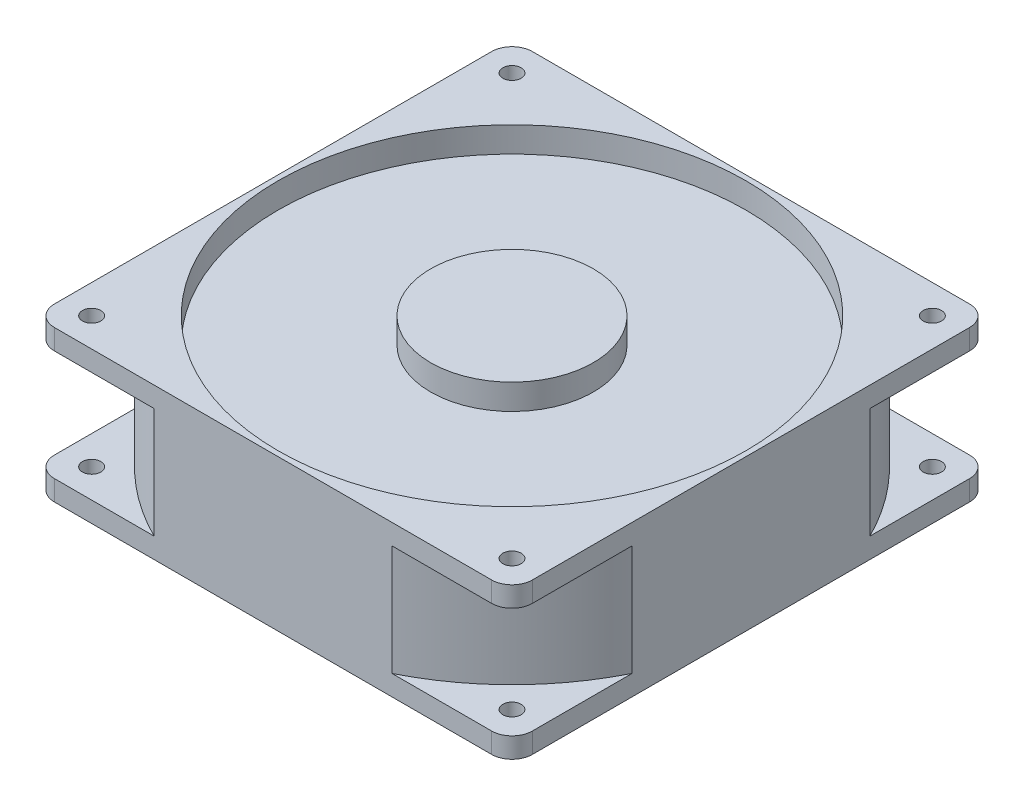
ISO-10303-21;
HEADER;
FILE_DESCRIPTION(('STEP AP214'),'2;1');
FILE_NAME('part.step','',(''),(''),'','','');
FILE_SCHEMA(('AUTOMOTIVE_DESIGN { 1 0 10303 214 1 1 1 1 }'));
ENDSEC;
DATA;
#1=APPLICATION_CONTEXT('core data for automotive mechanical design processes');
#2=APPLICATION_PROTOCOL_DEFINITION('international standard','automotive_design',2000,#1);
#3=PRODUCT_CONTEXT('',#1,'mechanical');
#4=PRODUCT('Part','Part','',(#3));
#5=PRODUCT_RELATED_PRODUCT_CATEGORY('part','',(#4));
#6=PRODUCT_DEFINITION_FORMATION('','',#4);
#7=PRODUCT_DEFINITION_CONTEXT('part definition',#1,'design');
#8=PRODUCT_DEFINITION('design','',#6,#7);
#9=PRODUCT_DEFINITION_SHAPE('','',#8);
#10=(LENGTH_UNIT() NAMED_UNIT(*) SI_UNIT(.MILLI.,.METRE.));
#11=(NAMED_UNIT(*) PLANE_ANGLE_UNIT() SI_UNIT($,.RADIAN.));
#12=(NAMED_UNIT(*) SI_UNIT($,.STERADIAN.) SOLID_ANGLE_UNIT());
#13=UNCERTAINTY_MEASURE_WITH_UNIT(LENGTH_MEASURE(1.E-05),#10,'distance_accuracy_value','');
#14=(GEOMETRIC_REPRESENTATION_CONTEXT(3) GLOBAL_UNCERTAINTY_ASSIGNED_CONTEXT((#13)) GLOBAL_UNIT_ASSIGNED_CONTEXT((#10,
#11,#12)) REPRESENTATION_CONTEXT('',''));
#15=CARTESIAN_POINT('',(0.,0.,0.));
#16=DIRECTION('',(0.,0.,1.));
#17=DIRECTION('',(1.,0.,0.));
#18=AXIS2_PLACEMENT_3D('',#15,#16,#17);
#19=CARTESIAN_POINT('',(2.67817733585345,37.75,-111.051162790698));
#20=DIRECTION('',(-1.,0.,0.));
#21=DIRECTION('',(0.,0.,1.));
#22=AXIS2_PLACEMENT_3D('',#19,#20,#21);
#23=PLANE('',#22);
#24=DIRECTION('',(0.,0.,-1.));
#25=VECTOR('',#24,1.);
#26=CARTESIAN_POINT('',(2.67817733585345,5.075,-111.051162790698));
#27=LINE('',#26,#25);
#28=CARTESIAN_POINT('',(2.67817733585345,5.075,3.24883720930234));
#29=VERTEX_POINT('',#28);
#30=CARTESIAN_POINT('',(2.67817733585345,5.075,-21.6515763748621));
#31=VERTEX_POINT('',#30);
#32=EDGE_CURVE('E367',#29,#31,#27,.T.);
#33=ORIENTED_EDGE('',*,*,#32,.F.);
#34=DIRECTION('',(0.,-1.,0.));
#35=VECTOR('',#34,1.);
#36=CARTESIAN_POINT('',(2.67817733585345,37.75,3.24883720930234));
#37=LINE('',#36,#35);
#38=CARTESIAN_POINT('',(2.67817733585345,0.,3.24883720930234));
#39=VERTEX_POINT('',#38);
#40=EDGE_CURVE('E267',#29,#39,#37,.T.);
#41=ORIENTED_EDGE('',*,*,#40,.T.);
#42=DIRECTION('',(0.,0.,-1.));
#43=VECTOR('',#42,1.);
#44=CARTESIAN_POINT('',(2.67817733585345,0.,-111.051162790698));
#45=LINE('',#44,#43);
#46=CARTESIAN_POINT('',(2.67817733585345,0.,-105.971162790698));
#47=VERTEX_POINT('',#46);
#48=EDGE_CURVE('E282',#39,#47,#45,.T.);
#49=ORIENTED_EDGE('',*,*,#48,.T.);
#50=DIRECTION('',(0.,-1.,0.));
#51=VECTOR('',#50,1.);
#52=CARTESIAN_POINT('',(2.67817733585345,37.75,-105.971162790698));
#53=LINE('',#52,#51);
#54=CARTESIAN_POINT('',(2.67817733585346,5.075,-105.971162790698));
#55=VERTEX_POINT('',#54);
#56=EDGE_CURVE('E268',#47,#55,#53,.F.);
#57=ORIENTED_EDGE('',*,*,#56,.T.);
#58=CARTESIAN_POINT('',(2.67817733585345,5.075,-81.0707492065333));
#59=VERTEX_POINT('',#58);
#60=EDGE_CURVE('E377',#59,#55,#27,.T.);
#61=ORIENTED_EDGE('',*,*,#60,.F.);
#62=DIRECTION('',(0.,1.,0.));
#63=VECTOR('',#62,1.);
#64=CARTESIAN_POINT('',(2.67817733585345,5.075,-81.0707492065333));
#65=LINE('',#64,#63);
#66=CARTESIAN_POINT('',(2.67817733585345,32.675,-81.0707492065333));
#67=VERTEX_POINT('',#66);
#68=EDGE_CURVE('E345',#67,#59,#65,.F.);
#69=ORIENTED_EDGE('',*,*,#68,.F.);
#70=DIRECTION('',(0.,0.,-1.));
#71=VECTOR('',#70,1.);
#72=CARTESIAN_POINT('',(2.67817733585345,32.675,-111.051162790698));
#73=LINE('',#72,#71);
#74=CARTESIAN_POINT('',(2.67817733585346,32.675,-105.971162790698));
#75=VERTEX_POINT('',#74);
#76=EDGE_CURVE('E403',#67,#75,#73,.T.);
#77=ORIENTED_EDGE('',*,*,#76,.T.);
#78=CARTESIAN_POINT('',(2.67817733585345,37.75,-105.971162790698));
#79=VERTEX_POINT('',#78);
#80=EDGE_CURVE('E271',#75,#79,#53,.F.);
#81=ORIENTED_EDGE('',*,*,#80,.T.);
#82=DIRECTION('',(0.,0.,-1.));
#83=VECTOR('',#82,1.);
#84=CARTESIAN_POINT('',(2.67817733585345,37.75,-111.051162790698));
#85=LINE('',#84,#83);
#86=CARTESIAN_POINT('',(2.67817733585345,37.75,3.24883720930234));
#87=VERTEX_POINT('',#86);
#88=EDGE_CURVE('E275',#87,#79,#85,.T.);
#89=ORIENTED_EDGE('',*,*,#88,.F.);
#90=CARTESIAN_POINT('',(2.67817733585345,32.675,3.24883720930234));
#91=VERTEX_POINT('',#90);
#92=EDGE_CURVE('E264',#87,#91,#37,.T.);
#93=ORIENTED_EDGE('',*,*,#92,.T.);
#94=CARTESIAN_POINT('',(2.67817733585345,32.675,-21.6515763748621));
#95=VERTEX_POINT('',#94);
#96=EDGE_CURVE('E49',#91,#95,#73,.T.);
#97=ORIENTED_EDGE('',*,*,#96,.T.);
#98=DIRECTION('',(0.,1.,0.));
#99=VECTOR('',#98,1.);
#100=CARTESIAN_POINT('',(2.67817733585345,5.075,-21.6515763748621));
#101=LINE('',#100,#99);
#102=EDGE_CURVE('E209',#31,#95,#101,.T.);
#103=ORIENTED_EDGE('',*,*,#102,.F.);
#104=EDGE_LOOP('',(#33,#41,#49,#57,#61,#69,#77,#81,#89,#93,#97,#103));
#105=FACE_BOUND('',#104,.T.);
#106=ADVANCED_FACE('F34',(#105),#23,.F.);
#107=CARTESIAN_POINT('',(-116.701822664147,37.75,-111.051162790698));
#108=DIRECTION('',(0.,0.,1.));
#109=DIRECTION('',(1.,0.,0.));
#110=AXIS2_PLACEMENT_3D('',#107,#108,#109);
#111=PLANE('',#110);
#112=DIRECTION('',(-1.,0.,0.));
#113=VECTOR('',#112,1.);
#114=CARTESIAN_POINT('',(-116.701822664147,5.075,-111.051162790698));
#115=LINE('',#114,#113);
#116=CARTESIAN_POINT('',(-2.40182266414654,5.075,-111.051162790698));
#117=VERTEX_POINT('',#116);
#118=CARTESIAN_POINT('',(-27.302236248311,5.075,-111.051162790698));
#119=VERTEX_POINT('',#118);
#120=EDGE_CURVE('E379',#117,#119,#115,.T.);
#121=ORIENTED_EDGE('',*,*,#120,.F.);
#122=DIRECTION('',(0.,-1.,0.));
#123=VECTOR('',#122,1.);
#124=CARTESIAN_POINT('',(-2.40182266414654,37.75,-111.051162790698));
#125=LINE('',#124,#123);
#126=CARTESIAN_POINT('',(-2.40182266414654,0.,-111.051162790698));
#127=VERTEX_POINT('',#126);
#128=EDGE_CURVE('E228',#117,#127,#125,.T.);
#129=ORIENTED_EDGE('',*,*,#128,.T.);
#130=DIRECTION('',(-1.,0.,0.));
#131=VECTOR('',#130,1.);
#132=CARTESIAN_POINT('',(-116.701822664147,0.,-111.051162790698));
#133=LINE('',#132,#131);
#134=CARTESIAN_POINT('',(-111.621822664147,0.,-111.051162790698));
#135=VERTEX_POINT('',#134);
#136=EDGE_CURVE('E279',#127,#135,#133,.T.);
#137=ORIENTED_EDGE('',*,*,#136,.T.);
#138=DIRECTION('',(0.,-1.,0.));
#139=VECTOR('',#138,1.);
#140=CARTESIAN_POINT('',(-111.621822664147,37.75,-111.051162790698));
#141=LINE('',#140,#139);
#142=CARTESIAN_POINT('',(-111.621822664147,5.075,-111.051162790698));
#143=VERTEX_POINT('',#142);
#144=EDGE_CURVE('E229',#135,#143,#141,.F.);
#145=ORIENTED_EDGE('',*,*,#144,.T.);
#146=CARTESIAN_POINT('',(-86.7214090799821,5.075,-111.051162790698));
#147=VERTEX_POINT('',#146);
#148=EDGE_CURVE('E383',#147,#143,#115,.T.);
#149=ORIENTED_EDGE('',*,*,#148,.F.);
#150=DIRECTION('',(0.,1.,0.));
#151=VECTOR('',#150,1.);
#152=CARTESIAN_POINT('',(-86.7214090799821,5.075,-111.051162790698));
#153=LINE('',#152,#151);
#154=CARTESIAN_POINT('',(-86.7214090799821,32.675,-111.051162790698));
#155=VERTEX_POINT('',#154);
#156=EDGE_CURVE('E349',#155,#147,#153,.F.);
#157=ORIENTED_EDGE('',*,*,#156,.F.);
#158=DIRECTION('',(-1.,0.,0.));
#159=VECTOR('',#158,1.);
#160=CARTESIAN_POINT('',(-116.701822664147,32.675,-111.051162790698));
#161=LINE('',#160,#159);
#162=CARTESIAN_POINT('',(-111.621822664147,32.675,-111.051162790698));
#163=VERTEX_POINT('',#162);
#164=EDGE_CURVE('E409',#155,#163,#161,.T.);
#165=ORIENTED_EDGE('',*,*,#164,.T.);
#166=CARTESIAN_POINT('',(-111.621822664147,37.75,-111.051162790698));
#167=VERTEX_POINT('',#166);
#168=EDGE_CURVE('E232',#163,#167,#141,.F.);
#169=ORIENTED_EDGE('',*,*,#168,.T.);
#170=DIRECTION('',(-1.,0.,0.));
#171=VECTOR('',#170,1.);
#172=CARTESIAN_POINT('',(-116.701822664147,37.75,-111.051162790698));
#173=LINE('',#172,#171);
#174=CARTESIAN_POINT('',(-2.40182266414654,37.75,-111.051162790698));
#175=VERTEX_POINT('',#174);
#176=EDGE_CURVE('E292',#175,#167,#173,.T.);
#177=ORIENTED_EDGE('',*,*,#176,.F.);
#178=CARTESIAN_POINT('',(-2.40182266414654,32.675,-111.051162790698));
#179=VERTEX_POINT('',#178);
#180=EDGE_CURVE('E225',#175,#179,#125,.T.);
#181=ORIENTED_EDGE('',*,*,#180,.T.);
#182=CARTESIAN_POINT('',(-27.302236248311,32.675,-111.051162790698));
#183=VERTEX_POINT('',#182);
#184=EDGE_CURVE('E406',#179,#183,#161,.T.);
#185=ORIENTED_EDGE('',*,*,#184,.T.);
#186=DIRECTION('',(0.,1.,0.));
#187=VECTOR('',#186,1.);
#188=CARTESIAN_POINT('',(-27.302236248311,5.075,-111.051162790698));
#189=LINE('',#188,#187);
#190=EDGE_CURVE('E347',#119,#183,#189,.T.);
#191=ORIENTED_EDGE('',*,*,#190,.F.);
#192=EDGE_LOOP('',(#121,#129,#137,#145,#149,#157,#165,#169,#177,#181,#185,#191));
#193=FACE_BOUND('',#192,.T.);
#194=ADVANCED_FACE('F450',(#193),#111,.F.);
#195=CARTESIAN_POINT('',(-116.701822664147,37.75,-111.051162790698));
#196=DIRECTION('',(1.,0.,0.));
#197=DIRECTION('',(0.,0.,-1.));
#198=AXIS2_PLACEMENT_3D('',#195,#196,#197);
#199=PLANE('',#198);
#200=DIRECTION('',(0.,0.,1.));
#201=VECTOR('',#200,1.);
#202=CARTESIAN_POINT('',(-116.701822664147,5.075,-111.051162790698));
#203=LINE('',#202,#201);
#204=CARTESIAN_POINT('',(-116.701822664147,5.075,-105.971162790698));
#205=VERTEX_POINT('',#204);
#206=CARTESIAN_POINT('',(-116.701822664147,5.075,-81.0707492065333));
#207=VERTEX_POINT('',#206);
#208=EDGE_CURVE('E385',#205,#207,#203,.T.);
#209=ORIENTED_EDGE('',*,*,#208,.F.);
#210=DIRECTION('',(0.,-1.,0.));
#211=VECTOR('',#210,1.);
#212=CARTESIAN_POINT('',(-116.701822664147,37.75,-105.971162790698));
#213=LINE('',#212,#211);
#214=CARTESIAN_POINT('',(-116.701822664147,0.,-105.971162790698));
#215=VERTEX_POINT('',#214);
#216=EDGE_CURVE('E240',#205,#215,#213,.T.);
#217=ORIENTED_EDGE('',*,*,#216,.T.);
#218=DIRECTION('',(0.,0.,1.));
#219=VECTOR('',#218,1.);
#220=CARTESIAN_POINT('',(-116.701822664147,0.,-111.051162790698));
#221=LINE('',#220,#219);
#222=CARTESIAN_POINT('',(-116.701822664147,0.,3.24883720930234));
#223=VERTEX_POINT('',#222);
#224=EDGE_CURVE('E276',#215,#223,#221,.T.);
#225=ORIENTED_EDGE('',*,*,#224,.T.);
#226=DIRECTION('',(0.,-1.,0.));
#227=VECTOR('',#226,1.);
#228=CARTESIAN_POINT('',(-116.701822664147,37.75,3.24883720930234));
#229=LINE('',#228,#227);
#230=CARTESIAN_POINT('',(-116.701822664147,5.075,3.24883720930234));
#231=VERTEX_POINT('',#230);
#232=EDGE_CURVE('E233',#223,#231,#229,.F.);
#233=ORIENTED_EDGE('',*,*,#232,.T.);
#234=CARTESIAN_POINT('',(-116.701822664147,5.075,-21.6515763748621));
#235=VERTEX_POINT('',#234);
#236=EDGE_CURVE('E371',#235,#231,#203,.T.);
#237=ORIENTED_EDGE('',*,*,#236,.F.);
#238=DIRECTION('',(0.,1.,0.));
#239=VECTOR('',#238,1.);
#240=CARTESIAN_POINT('',(-116.701822664147,5.075,-21.6515763748621));
#241=LINE('',#240,#239);
#242=CARTESIAN_POINT('',(-116.701822664147,32.675,-21.6515763748621));
#243=VERTEX_POINT('',#242);
#244=EDGE_CURVE('E353',#243,#235,#241,.F.);
#245=ORIENTED_EDGE('',*,*,#244,.F.);
#246=DIRECTION('',(0.,0.,1.));
#247=VECTOR('',#246,1.);
#248=CARTESIAN_POINT('',(-116.701822664147,32.675,-111.051162790698));
#249=LINE('',#248,#247);
#250=CARTESIAN_POINT('',(-116.701822664147,32.675,3.24883720930234));
#251=VERTEX_POINT('',#250);
#252=EDGE_CURVE('E399',#243,#251,#249,.T.);
#253=ORIENTED_EDGE('',*,*,#252,.T.);
#254=CARTESIAN_POINT('',(-116.701822664147,37.75,3.24883720930234));
#255=VERTEX_POINT('',#254);
#256=EDGE_CURVE('E236',#251,#255,#229,.F.);
#257=ORIENTED_EDGE('',*,*,#256,.T.);
#258=DIRECTION('',(0.,0.,1.));
#259=VECTOR('',#258,1.);
#260=CARTESIAN_POINT('',(-116.701822664147,37.75,-111.051162790698));
#261=LINE('',#260,#259);
#262=CARTESIAN_POINT('',(-116.701822664147,37.75,-105.971162790698));
#263=VERTEX_POINT('',#262);
#264=EDGE_CURVE('E289',#263,#255,#261,.T.);
#265=ORIENTED_EDGE('',*,*,#264,.F.);
#266=CARTESIAN_POINT('',(-116.701822664147,32.675,-105.971162790698));
#267=VERTEX_POINT('',#266);
#268=EDGE_CURVE('E237',#263,#267,#213,.T.);
#269=ORIENTED_EDGE('',*,*,#268,.T.);
#270=CARTESIAN_POINT('',(-116.701822664147,32.675,-81.0707492065333));
#271=VERTEX_POINT('',#270);
#272=EDGE_CURVE('E412',#267,#271,#249,.T.);
#273=ORIENTED_EDGE('',*,*,#272,.T.);
#274=DIRECTION('',(0.,1.,0.));
#275=VECTOR('',#274,1.);
#276=CARTESIAN_POINT('',(-116.701822664147,5.075,-81.0707492065333));
#277=LINE('',#276,#275);
#278=EDGE_CURVE('E351',#207,#271,#277,.T.);
#279=ORIENTED_EDGE('',*,*,#278,.F.);
#280=EDGE_LOOP('',(#209,#217,#225,#233,#237,#245,#253,#257,#265,#269,#273,#279));
#281=FACE_BOUND('',#280,.T.);
#282=ADVANCED_FACE('F435',(#281),#199,.F.);
#283=CARTESIAN_POINT('',(-116.701822664147,37.75,8.32883720930234));
#284=DIRECTION('',(0.,0.,-1.));
#285=DIRECTION('',(-1.,0.,0.));
#286=AXIS2_PLACEMENT_3D('',#283,#284,#285);
#287=PLANE('',#286);
#288=DIRECTION('',(1.,0.,0.));
#289=VECTOR('',#288,1.);
#290=CARTESIAN_POINT('',(-116.701822664147,5.075,8.32883720930234));
#291=LINE('',#290,#289);
#292=CARTESIAN_POINT('',(-111.621822664147,5.075,8.32883720930234));
#293=VERTEX_POINT('',#292);
#294=CARTESIAN_POINT('',(-86.7214090799821,5.075,8.32883720930234));
#295=VERTEX_POINT('',#294);
#296=EDGE_CURVE('E372',#293,#295,#291,.T.);
#297=ORIENTED_EDGE('',*,*,#296,.F.);
#298=DIRECTION('',(0.,-1.,0.));
#299=VECTOR('',#298,1.);
#300=CARTESIAN_POINT('',(-111.621822664147,37.75,8.32883720930234));
#301=LINE('',#300,#299);
#302=CARTESIAN_POINT('',(-111.621822664147,0.,8.32883720930234));
#303=VERTEX_POINT('',#302);
#304=EDGE_CURVE('E255',#293,#303,#301,.T.);
#305=ORIENTED_EDGE('',*,*,#304,.T.);
#306=DIRECTION('',(1.,0.,0.));
#307=VECTOR('',#306,1.);
#308=CARTESIAN_POINT('',(-116.701822664147,0.,8.32883720930234));
#309=LINE('',#308,#307);
#310=CARTESIAN_POINT('',(-2.40182266414657,0.,8.32883720930234));
#311=VERTEX_POINT('',#310);
#312=EDGE_CURVE('E272',#303,#311,#309,.T.);
#313=ORIENTED_EDGE('',*,*,#312,.T.);
#314=DIRECTION('',(0.,-1.,0.));
#315=VECTOR('',#314,1.);
#316=CARTESIAN_POINT('',(-2.40182266414654,37.75,8.32883720930234));
#317=LINE('',#316,#315);
#318=CARTESIAN_POINT('',(-2.40182266414655,5.075,8.32883720930234));
#319=VERTEX_POINT('',#318);
#320=EDGE_CURVE('E249',#311,#319,#317,.F.);
#321=ORIENTED_EDGE('',*,*,#320,.T.);
#322=CARTESIAN_POINT('',(-27.302236248311,5.075,8.32883720930234));
#323=VERTEX_POINT('',#322);
#324=EDGE_CURVE('E218',#323,#319,#291,.T.);
#325=ORIENTED_EDGE('',*,*,#324,.F.);
#326=DIRECTION('',(0.,1.,0.));
#327=VECTOR('',#326,1.);
#328=CARTESIAN_POINT('',(-27.302236248311,5.075,8.32883720930234));
#329=LINE('',#328,#327);
#330=CARTESIAN_POINT('',(-27.302236248311,32.675,8.32883720930234));
#331=VERTEX_POINT('',#330);
#332=EDGE_CURVE('E42',#331,#323,#329,.F.);
#333=ORIENTED_EDGE('',*,*,#332,.F.);
#334=DIRECTION('',(1.,0.,0.));
#335=VECTOR('',#334,1.);
#336=CARTESIAN_POINT('',(-116.701822664147,32.675,8.32883720930234));
#337=LINE('',#336,#335);
#338=CARTESIAN_POINT('',(-2.40182266414655,32.675,8.32883720930234));
#339=VERTEX_POINT('',#338);
#340=EDGE_CURVE('E194',#331,#339,#337,.T.);
#341=ORIENTED_EDGE('',*,*,#340,.T.);
#342=CARTESIAN_POINT('',(-2.40182266414657,37.75,8.32883720930234));
#343=VERTEX_POINT('',#342);
#344=EDGE_CURVE('E251',#339,#343,#317,.F.);
#345=ORIENTED_EDGE('',*,*,#344,.T.);
#346=DIRECTION('',(1.,0.,0.));
#347=VECTOR('',#346,1.);
#348=CARTESIAN_POINT('',(-116.701822664147,37.75,8.32883720930234));
#349=LINE('',#348,#347);
#350=CARTESIAN_POINT('',(-111.621822664147,37.75,8.32883720930234));
#351=VERTEX_POINT('',#350);
#352=EDGE_CURVE('E286',#351,#343,#349,.T.);
#353=ORIENTED_EDGE('',*,*,#352,.F.);
#354=CARTESIAN_POINT('',(-111.621822664147,32.675,8.32883720930234));
#355=VERTEX_POINT('',#354);
#356=EDGE_CURVE('E252',#351,#355,#301,.T.);
#357=ORIENTED_EDGE('',*,*,#356,.T.);
#358=CARTESIAN_POINT('',(-86.7214090799821,32.675,8.32883720930234));
#359=VERTEX_POINT('',#358);
#360=EDGE_CURVE('E57',#355,#359,#337,.T.);
#361=ORIENTED_EDGE('',*,*,#360,.T.);
#362=DIRECTION('',(0.,1.,0.));
#363=VECTOR('',#362,1.);
#364=CARTESIAN_POINT('',(-86.7214090799821,5.075,8.32883720930234));
#365=LINE('',#364,#363);
#366=EDGE_CURVE('E11',#295,#359,#365,.T.);
#367=ORIENTED_EDGE('',*,*,#366,.F.);
#368=EDGE_LOOP('',(#297,#305,#313,#321,#325,#333,#341,#345,#353,#357,#361,#367));
#369=FACE_BOUND('',#368,.T.);
#370=ADVANCED_FACE('F216',(#369),#287,.F.);
#371=CARTESIAN_POINT('',(-109.511822664147,0.,-103.861162790698));
#372=DIRECTION('',(0.,1.,0.));
#373=DIRECTION('',(0.,0.,1.));
#374=AXIS2_PLACEMENT_3D('',#371,#372,#373);
#375=CYLINDRICAL_SURFACE('',#374,2.28599999999999);
#376=CARTESIAN_POINT('',(-109.511822664147,0.,-103.861162790698));
#377=DIRECTION('',(0.,1.,0.));
#378=DIRECTION('',(0.,0.,1.));
#379=AXIS2_PLACEMENT_3D('',#376,#377,#378);
#380=CIRCLE('',#379,2.28599999999999);
#381=CARTESIAN_POINT('',(-109.511822664147,0.,-101.575162790698));
#382=VERTEX_POINT('',#381);
#383=EDGE_CURVE('E285',#382,#382,#380,.T.);
#384=ORIENTED_EDGE('',*,*,#383,.F.);
#385=EDGE_LOOP('',(#384));
#386=FACE_BOUND('',#385,.T.);
#387=CARTESIAN_POINT('',(-109.511822664147,5.075,-103.861162790698));
#388=DIRECTION('',(0.,1.,0.));
#389=DIRECTION('',(0.,0.,1.));
#390=AXIS2_PLACEMENT_3D('',#387,#388,#389);
#391=CIRCLE('',#390,2.28599999999999);
#392=CARTESIAN_POINT('',(-109.511822664147,5.075,-101.575162790698));
#393=VERTEX_POINT('',#392);
#394=EDGE_CURVE('E355',#393,#393,#391,.F.);
#395=ORIENTED_EDGE('',*,*,#394,.F.);
#396=EDGE_LOOP('',(#395));
#397=FACE_BOUND('',#396,.T.);
#398=ADVANCED_FACE('F533',(#386,#397),#375,.F.);
#399=CARTESIAN_POINT('',(-109.511822664147,0.,1.1388372093023));
#400=DIRECTION('',(0.,1.,0.));
#401=DIRECTION('',(0.,0.,1.));
#402=AXIS2_PLACEMENT_3D('',#399,#400,#401);
#403=CYLINDRICAL_SURFACE('',#402,2.28599999999999);
#404=CARTESIAN_POINT('',(-109.511822664147,0.,1.1388372093023));
#405=DIRECTION('',(0.,1.,0.));
#406=DIRECTION('',(0.,0.,1.));
#407=AXIS2_PLACEMENT_3D('',#404,#405,#406);
#408=CIRCLE('',#407,2.28599999999999);
#409=CARTESIAN_POINT('',(-109.511822664147,0.,3.4248372093023));
#410=VERTEX_POINT('',#409);
#411=EDGE_CURVE('E306',#410,#410,#408,.T.);
#412=ORIENTED_EDGE('',*,*,#411,.F.);
#413=EDGE_LOOP('',(#412));
#414=FACE_BOUND('',#413,.T.);
#415=CARTESIAN_POINT('',(-109.511822664147,5.075,1.1388372093023));
#416=DIRECTION('',(0.,1.,0.));
#417=DIRECTION('',(0.,0.,1.));
#418=AXIS2_PLACEMENT_3D('',#415,#416,#417);
#419=CIRCLE('',#418,2.28599999999999);
#420=CARTESIAN_POINT('',(-109.511822664147,5.075,3.4248372093023));
#421=VERTEX_POINT('',#420);
#422=EDGE_CURVE('E358',#421,#421,#419,.F.);
#423=ORIENTED_EDGE('',*,*,#422,.F.);
#424=EDGE_LOOP('',(#423));
#425=FACE_BOUND('',#424,.T.);
#426=ADVANCED_FACE('F550',(#414,#425),#403,.F.);
#427=CARTESIAN_POINT('',(-4.51182266414656,0.,1.1388372093023));
#428=DIRECTION('',(0.,1.,0.));
#429=DIRECTION('',(0.,0.,1.));
#430=AXIS2_PLACEMENT_3D('',#427,#428,#429);
#431=CYLINDRICAL_SURFACE('',#430,2.28600000000001);
#432=CARTESIAN_POINT('',(-4.51182266414656,0.,1.1388372093023));
#433=DIRECTION('',(0.,1.,0.));
#434=DIRECTION('',(0.,0.,1.));
#435=AXIS2_PLACEMENT_3D('',#432,#433,#434);
#436=CIRCLE('',#435,2.28600000000001);
#437=CARTESIAN_POINT('',(-4.51182266414656,0.,3.42483720930231));
#438=VERTEX_POINT('',#437);
#439=EDGE_CURVE('E313',#438,#438,#436,.T.);
#440=ORIENTED_EDGE('',*,*,#439,.F.);
#441=EDGE_LOOP('',(#440));
#442=FACE_BOUND('',#441,.T.);
#443=CARTESIAN_POINT('',(-4.51182266414656,5.075,1.1388372093023));
#444=DIRECTION('',(0.,1.,0.));
#445=DIRECTION('',(0.,0.,1.));
#446=AXIS2_PLACEMENT_3D('',#443,#444,#445);
#447=CIRCLE('',#446,2.28600000000001);
#448=CARTESIAN_POINT('',(-4.51182266414656,5.075,3.42483720930231));
#449=VERTEX_POINT('',#448);
#450=EDGE_CURVE('E361',#449,#449,#447,.F.);
#451=ORIENTED_EDGE('',*,*,#450,.F.);
#452=EDGE_LOOP('',(#451));
#453=FACE_BOUND('',#452,.T.);
#454=ADVANCED_FACE('F555',(#442,#453),#431,.F.);
#455=CARTESIAN_POINT('',(-4.51182266414654,0.,-103.861162790698));
#456=DIRECTION('',(0.,1.,0.));
#457=DIRECTION('',(0.,0.,1.));
#458=AXIS2_PLACEMENT_3D('',#455,#456,#457);
#459=CYLINDRICAL_SURFACE('',#458,2.28600000000001);
#460=CARTESIAN_POINT('',(-4.51182266414654,0.,-103.861162790698));
#461=DIRECTION('',(0.,1.,0.));
#462=DIRECTION('',(0.,0.,1.));
#463=AXIS2_PLACEMENT_3D('',#460,#461,#462);
#464=CIRCLE('',#463,2.28600000000001);
#465=CARTESIAN_POINT('',(-4.51182266414654,0.,-101.575162790698));
#466=VERTEX_POINT('',#465);
#467=EDGE_CURVE('E300',#466,#466,#464,.T.);
#468=ORIENTED_EDGE('',*,*,#467,.F.);
#469=EDGE_LOOP('',(#468));
#470=FACE_BOUND('',#469,.T.);
#471=CARTESIAN_POINT('',(-4.51182266414654,5.075,-103.861162790698));
#472=DIRECTION('',(0.,1.,0.));
#473=DIRECTION('',(0.,0.,1.));
#474=AXIS2_PLACEMENT_3D('',#471,#472,#473);
#475=CIRCLE('',#474,2.28600000000001);
#476=CARTESIAN_POINT('',(-4.51182266414654,5.075,-101.575162790698));
#477=VERTEX_POINT('',#476);
#478=EDGE_CURVE('E364',#477,#477,#475,.F.);
#479=ORIENTED_EDGE('',*,*,#478,.F.);
#480=EDGE_LOOP('',(#479));
#481=FACE_BOUND('',#480,.T.);
#482=ADVANCED_FACE('F522',(#470,#481),#459,.F.);
#483=CARTESIAN_POINT('',(-2.40182266414655,37.75,3.24883720930234));
#484=DIRECTION('',(0.,-1.,0.));
#485=DIRECTION('',(0.,0.,-1.));
#486=AXIS2_PLACEMENT_3D('',#483,#484,#485);
#487=CYLINDRICAL_SURFACE('',#486,5.08);
#488=ORIENTED_EDGE('',*,*,#40,.F.);
#489=CARTESIAN_POINT('',(-2.40182266414655,5.075,3.24883720930234));
#490=DIRECTION('',(0.,1.,0.));
#491=DIRECTION('',(0.,0.,1.));
#492=AXIS2_PLACEMENT_3D('',#489,#490,#491);
#493=CIRCLE('',#492,5.08);
#494=EDGE_CURVE('E368',#29,#319,#493,.F.);
#495=ORIENTED_EDGE('',*,*,#494,.T.);
#496=ORIENTED_EDGE('',*,*,#320,.F.);
#497=CARTESIAN_POINT('',(-2.40182266414655,0.,3.24883720930234));
#498=DIRECTION('',(0.,1.,0.));
#499=DIRECTION('',(0.,0.,1.));
#500=AXIS2_PLACEMENT_3D('',#497,#498,#499);
#501=CIRCLE('',#500,5.08);
#502=EDGE_CURVE('E256',#39,#311,#501,.F.);
#503=ORIENTED_EDGE('',*,*,#502,.F.);
#504=EDGE_LOOP('',(#488,#495,#496,#503));
#505=FACE_BOUND('',#504,.T.);
#506=ADVANCED_FACE('F499',(#505),#487,.T.);
#507=CARTESIAN_POINT('',(-111.621822664147,37.75,3.24883720930234));
#508=DIRECTION('',(0.,-1.,0.));
#509=DIRECTION('',(0.,0.,-1.));
#510=AXIS2_PLACEMENT_3D('',#507,#508,#509);
#511=CYLINDRICAL_SURFACE('',#510,5.08);
#512=ORIENTED_EDGE('',*,*,#304,.F.);
#513=CARTESIAN_POINT('',(-111.621822664147,5.075,3.24883720930234));
#514=DIRECTION('',(0.,1.,0.));
#515=DIRECTION('',(0.,0.,1.));
#516=AXIS2_PLACEMENT_3D('',#513,#514,#515);
#517=CIRCLE('',#516,5.08);
#518=EDGE_CURVE('E374',#293,#231,#517,.F.);
#519=ORIENTED_EDGE('',*,*,#518,.T.);
#520=ORIENTED_EDGE('',*,*,#232,.F.);
#521=CARTESIAN_POINT('',(-111.621822664147,0.,3.24883720930234));
#522=DIRECTION('',(0.,1.,0.));
#523=DIRECTION('',(0.,0.,1.));
#524=AXIS2_PLACEMENT_3D('',#521,#522,#523);
#525=CIRCLE('',#524,5.08);
#526=EDGE_CURVE('E258',#303,#223,#525,.F.);
#527=ORIENTED_EDGE('',*,*,#526,.F.);
#528=EDGE_LOOP('',(#512,#519,#520,#527));
#529=FACE_BOUND('',#528,.T.);
#530=ADVANCED_FACE('F488',(#529),#511,.T.);
#531=CARTESIAN_POINT('',(-2.40182266414654,37.75,-105.971162790698));
#532=DIRECTION('',(0.,-1.,0.));
#533=DIRECTION('',(0.,0.,-1.));
#534=AXIS2_PLACEMENT_3D('',#531,#532,#533);
#535=CYLINDRICAL_SURFACE('',#534,5.08);
#536=ORIENTED_EDGE('',*,*,#128,.F.);
#537=CARTESIAN_POINT('',(-2.40182266414654,5.075,-105.971162790698));
#538=DIRECTION('',(0.,1.,0.));
#539=DIRECTION('',(0.,0.,1.));
#540=AXIS2_PLACEMENT_3D('',#537,#538,#539);
#541=CIRCLE('',#540,5.08);
#542=EDGE_CURVE('E380',#117,#55,#541,.F.);
#543=ORIENTED_EDGE('',*,*,#542,.T.);
#544=ORIENTED_EDGE('',*,*,#56,.F.);
#545=CARTESIAN_POINT('',(-2.40182266414654,0.,-105.971162790698));
#546=DIRECTION('',(0.,1.,0.));
#547=DIRECTION('',(0.,0.,1.));
#548=AXIS2_PLACEMENT_3D('',#545,#546,#547);
#549=CIRCLE('',#548,5.08);
#550=EDGE_CURVE('E260',#127,#47,#549,.F.);
#551=ORIENTED_EDGE('',*,*,#550,.F.);
#552=EDGE_LOOP('',(#536,#543,#544,#551));
#553=FACE_BOUND('',#552,.T.);
#554=ADVANCED_FACE('F665',(#553),#535,.T.);
#555=CARTESIAN_POINT('',(-111.621822664147,37.75,-105.971162790698));
#556=DIRECTION('',(0.,-1.,0.));
#557=DIRECTION('',(0.,0.,-1.));
#558=AXIS2_PLACEMENT_3D('',#555,#556,#557);
#559=CYLINDRICAL_SURFACE('',#558,5.08);
#560=ORIENTED_EDGE('',*,*,#216,.F.);
#561=CARTESIAN_POINT('',(-111.621822664147,5.075,-105.971162790698));
#562=DIRECTION('',(0.,1.,0.));
#563=DIRECTION('',(0.,0.,1.));
#564=AXIS2_PLACEMENT_3D('',#561,#562,#563);
#565=CIRCLE('',#564,5.08);
#566=EDGE_CURVE('E219',#205,#143,#565,.F.);
#567=ORIENTED_EDGE('',*,*,#566,.T.);
#568=ORIENTED_EDGE('',*,*,#144,.F.);
#569=CARTESIAN_POINT('',(-111.621822664147,0.,-105.971162790698));
#570=DIRECTION('',(0.,1.,0.));
#571=DIRECTION('',(0.,0.,1.));
#572=AXIS2_PLACEMENT_3D('',#569,#570,#571);
#573=CIRCLE('',#572,5.08);
#574=EDGE_CURVE('E262',#215,#135,#573,.F.);
#575=ORIENTED_EDGE('',*,*,#574,.F.);
#576=EDGE_LOOP('',(#560,#567,#568,#575));
#577=FACE_BOUND('',#576,.T.);
#578=ADVANCED_FACE('F540',(#577),#559,.T.);
#579=CARTESIAN_POINT('',(0.,37.75,0.));
#580=DIRECTION('',(0.,1.,0.));
#581=DIRECTION('',(0.,0.,1.));
#582=AXIS2_PLACEMENT_3D('',#579,#580,#581);
#583=PLANE('',#582);
#584=CARTESIAN_POINT('',(-57.0118226641465,37.75,-51.3611627906977));
#585=DIRECTION('',(0.,1.,0.));
#586=DIRECTION('',(0.,0.,1.));
#587=AXIS2_PLACEMENT_3D('',#584,#585,#586);
#588=CIRCLE('',#587,58.4197345497268);
#589=CARTESIAN_POINT('',(-57.0118226641465,37.75,7.05857175902914));
#590=VERTEX_POINT('',#589);
#591=EDGE_CURVE('E321',#590,#590,#588,.T.);
#592=ORIENTED_EDGE('',*,*,#591,.F.);
#593=EDGE_LOOP('',(#592));
#594=FACE_BOUND('',#593,.T.);
#595=CARTESIAN_POINT('',(-4.51182266414654,37.75,-103.861162790698));
#596=DIRECTION('',(0.,1.,0.));
#597=DIRECTION('',(0.,0.,1.));
#598=AXIS2_PLACEMENT_3D('',#595,#596,#597);
#599=CIRCLE('',#598,2.28600000000001);
#600=CARTESIAN_POINT('',(-4.51182266414654,37.75,-101.575162790698));
#601=VERTEX_POINT('',#600);
#602=EDGE_CURVE('E316',#601,#601,#599,.T.);
#603=ORIENTED_EDGE('',*,*,#602,.F.);
#604=EDGE_LOOP('',(#603));
#605=FACE_BOUND('',#604,.T.);
#606=CARTESIAN_POINT('',(-4.51182266414656,37.75,1.1388372093023));
#607=DIRECTION('',(0.,1.,0.));
#608=DIRECTION('',(0.,0.,1.));
#609=AXIS2_PLACEMENT_3D('',#606,#607,#608);
#610=CIRCLE('',#609,2.28600000000001);
#611=CARTESIAN_POINT('',(-4.51182266414656,37.75,3.42483720930231));
#612=VERTEX_POINT('',#611);
#613=EDGE_CURVE('E310',#612,#612,#610,.T.);
#614=ORIENTED_EDGE('',*,*,#613,.F.);
#615=EDGE_LOOP('',(#614));
#616=FACE_BOUND('',#615,.T.);
#617=CARTESIAN_POINT('',(-109.511822664147,37.75,1.1388372093023));
#618=DIRECTION('',(0.,1.,0.));
#619=DIRECTION('',(0.,0.,1.));
#620=AXIS2_PLACEMENT_3D('',#617,#618,#619);
#621=CIRCLE('',#620,2.28599999999999);
#622=CARTESIAN_POINT('',(-109.511822664147,37.75,3.4248372093023));
#623=VERTEX_POINT('',#622);
#624=EDGE_CURVE('E303',#623,#623,#621,.T.);
#625=ORIENTED_EDGE('',*,*,#624,.F.);
#626=EDGE_LOOP('',(#625));
#627=FACE_BOUND('',#626,.T.);
#628=CARTESIAN_POINT('',(-109.511822664147,37.75,-103.861162790698));
#629=DIRECTION('',(0.,1.,0.));
#630=DIRECTION('',(0.,0.,1.));
#631=AXIS2_PLACEMENT_3D('',#628,#629,#630);
#632=CIRCLE('',#631,2.28599999999999);
#633=CARTESIAN_POINT('',(-109.511822664147,37.75,-101.575162790698));
#634=VERTEX_POINT('',#633);
#635=EDGE_CURVE('E297',#634,#634,#632,.T.);
#636=ORIENTED_EDGE('',*,*,#635,.F.);
#637=EDGE_LOOP('',(#636));
#638=FACE_BOUND('',#637,.T.);
#639=ORIENTED_EDGE('',*,*,#352,.T.);
#640=CARTESIAN_POINT('',(-2.40182266414655,37.75,3.24883720930234));
#641=DIRECTION('',(0.,1.,0.));
#642=DIRECTION('',(0.,0.,1.));
#643=AXIS2_PLACEMENT_3D('',#640,#641,#642);
#644=CIRCLE('',#643,5.08);
#645=EDGE_CURVE('E241',#343,#87,#644,.T.);
#646=ORIENTED_EDGE('',*,*,#645,.T.);
#647=ORIENTED_EDGE('',*,*,#88,.T.);
#648=CARTESIAN_POINT('',(-2.40182266414654,37.75,-105.971162790698));
#649=DIRECTION('',(0.,1.,0.));
#650=DIRECTION('',(0.,0.,1.));
#651=AXIS2_PLACEMENT_3D('',#648,#649,#650);
#652=CIRCLE('',#651,5.08);
#653=EDGE_CURVE('E245',#79,#175,#652,.T.);
#654=ORIENTED_EDGE('',*,*,#653,.T.);
#655=ORIENTED_EDGE('',*,*,#176,.T.);
#656=CARTESIAN_POINT('',(-111.621822664147,37.75,-105.971162790698));
#657=DIRECTION('',(0.,1.,0.));
#658=DIRECTION('',(0.,0.,1.));
#659=AXIS2_PLACEMENT_3D('',#656,#657,#658);
#660=CIRCLE('',#659,5.08);
#661=EDGE_CURVE('E247',#167,#263,#660,.T.);
#662=ORIENTED_EDGE('',*,*,#661,.T.);
#663=ORIENTED_EDGE('',*,*,#264,.T.);
#664=CARTESIAN_POINT('',(-111.621822664147,37.75,3.24883720930234));
#665=DIRECTION('',(0.,1.,0.));
#666=DIRECTION('',(0.,0.,1.));
#667=AXIS2_PLACEMENT_3D('',#664,#665,#666);
#668=CIRCLE('',#667,5.08);
#669=EDGE_CURVE('E243',#255,#351,#668,.T.);
#670=ORIENTED_EDGE('',*,*,#669,.T.);
#671=EDGE_LOOP('',(#639,#646,#647,#654,#655,#662,#663,#670));
#672=FACE_BOUND('',#671,.T.);
#673=ADVANCED_FACE('F453',(#594,#605,#616,#627,#638,#672),#583,.T.);
#674=CARTESIAN_POINT('',(0.,0.,0.));
#675=DIRECTION('',(0.,1.,0.));
#676=DIRECTION('',(0.,0.,1.));
#677=AXIS2_PLACEMENT_3D('',#674,#675,#676);
#678=PLANE('',#677);
#679=CARTESIAN_POINT('',(-57.0118226641465,0.,-51.3611627906977));
#680=DIRECTION('',(0.,-1.,0.));
#681=DIRECTION('',(0.,0.,-1.));
#682=AXIS2_PLACEMENT_3D('',#679,#680,#681);
#683=CIRCLE('',#682,58.42);
#684=CARTESIAN_POINT('',(-57.0118226641465,0.,-109.781162790698));
#685=VERTEX_POINT('',#684);
#686=EDGE_CURVE('E327',#685,#685,#683,.T.);
#687=ORIENTED_EDGE('',*,*,#686,.F.);
#688=EDGE_LOOP('',(#687));
#689=FACE_BOUND('',#688,.T.);
#690=ORIENTED_EDGE('',*,*,#467,.T.);
#691=EDGE_LOOP('',(#690));
#692=FACE_BOUND('',#691,.T.);
#693=ORIENTED_EDGE('',*,*,#439,.T.);
#694=EDGE_LOOP('',(#693));
#695=FACE_BOUND('',#694,.T.);
#696=ORIENTED_EDGE('',*,*,#411,.T.);
#697=EDGE_LOOP('',(#696));
#698=FACE_BOUND('',#697,.T.);
#699=ORIENTED_EDGE('',*,*,#383,.T.);
#700=EDGE_LOOP('',(#699));
#701=FACE_BOUND('',#700,.T.);
#702=ORIENTED_EDGE('',*,*,#48,.F.);
#703=ORIENTED_EDGE('',*,*,#502,.T.);
#704=ORIENTED_EDGE('',*,*,#312,.F.);
#705=ORIENTED_EDGE('',*,*,#526,.T.);
#706=ORIENTED_EDGE('',*,*,#224,.F.);
#707=ORIENTED_EDGE('',*,*,#574,.T.);
#708=ORIENTED_EDGE('',*,*,#136,.F.);
#709=ORIENTED_EDGE('',*,*,#550,.T.);
#710=EDGE_LOOP('',(#702,#703,#704,#705,#706,#707,#708,#709));
#711=FACE_BOUND('',#710,.T.);
#712=ADVANCED_FACE('F494',(#689,#692,#695,#698,#701,#711),#678,.F.);
#713=CARTESIAN_POINT('',(-109.511822664147,32.675,-103.861162790698));
#714=DIRECTION('',(0.,1.,0.));
#715=DIRECTION('',(0.,0.,1.));
#716=AXIS2_PLACEMENT_3D('',#713,#714,#715);
#717=CIRCLE('',#716,2.28599999999999);
#718=CARTESIAN_POINT('',(-109.511822664147,32.675,-101.575162790698));
#719=VERTEX_POINT('',#718);
#720=EDGE_CURVE('E387',#719,#719,#717,.F.);
#721=ORIENTED_EDGE('',*,*,#720,.T.);
#722=EDGE_LOOP('',(#721));
#723=FACE_BOUND('',#722,.T.);
#724=ORIENTED_EDGE('',*,*,#635,.T.);
#725=EDGE_LOOP('',(#724));
#726=FACE_BOUND('',#725,.T.);
#727=ADVANCED_FACE('F536',(#723,#726),#375,.F.);
#728=CARTESIAN_POINT('',(-109.511822664147,32.675,1.1388372093023));
#729=DIRECTION('',(0.,1.,0.));
#730=DIRECTION('',(0.,0.,1.));
#731=AXIS2_PLACEMENT_3D('',#728,#729,#730);
#732=CIRCLE('',#731,2.28599999999999);
#733=CARTESIAN_POINT('',(-109.511822664147,32.675,3.4248372093023));
#734=VERTEX_POINT('',#733);
#735=EDGE_CURVE('E390',#734,#734,#732,.F.);
#736=ORIENTED_EDGE('',*,*,#735,.T.);
#737=EDGE_LOOP('',(#736));
#738=FACE_BOUND('',#737,.T.);
#739=ORIENTED_EDGE('',*,*,#624,.T.);
#740=EDGE_LOOP('',(#739));
#741=FACE_BOUND('',#740,.T.);
#742=ADVANCED_FACE('F544',(#738,#741),#403,.F.);
#743=CARTESIAN_POINT('',(-4.51182266414656,32.675,1.1388372093023));
#744=DIRECTION('',(0.,1.,0.));
#745=DIRECTION('',(0.,0.,1.));
#746=AXIS2_PLACEMENT_3D('',#743,#744,#745);
#747=CIRCLE('',#746,2.28600000000001);
#748=CARTESIAN_POINT('',(-4.51182266414656,32.675,3.42483720930231));
#749=VERTEX_POINT('',#748);
#750=EDGE_CURVE('E393',#749,#749,#747,.F.);
#751=ORIENTED_EDGE('',*,*,#750,.T.);
#752=EDGE_LOOP('',(#751));
#753=FACE_BOUND('',#752,.T.);
#754=ORIENTED_EDGE('',*,*,#613,.T.);
#755=EDGE_LOOP('',(#754));
#756=FACE_BOUND('',#755,.T.);
#757=ADVANCED_FACE('F548',(#753,#756),#431,.F.);
#758=CARTESIAN_POINT('',(-4.51182266414654,32.675,-103.861162790698));
#759=DIRECTION('',(0.,1.,0.));
#760=DIRECTION('',(0.,0.,1.));
#761=AXIS2_PLACEMENT_3D('',#758,#759,#760);
#762=CIRCLE('',#761,2.28600000000001);
#763=CARTESIAN_POINT('',(-4.51182266414654,32.675,-101.575162790698));
#764=VERTEX_POINT('',#763);
#765=EDGE_CURVE('E396',#764,#764,#762,.F.);
#766=ORIENTED_EDGE('',*,*,#765,.T.);
#767=EDGE_LOOP('',(#766));
#768=FACE_BOUND('',#767,.T.);
#769=ORIENTED_EDGE('',*,*,#602,.T.);
#770=EDGE_LOOP('',(#769));
#771=FACE_BOUND('',#770,.T.);
#772=ADVANCED_FACE('F553',(#768,#771),#459,.F.);
#773=CARTESIAN_POINT('',(-57.0118226641465,31.4,-51.3611627906977));
#774=DIRECTION('',(0.,1.,0.));
#775=DIRECTION('',(0.,0.,1.));
#776=AXIS2_PLACEMENT_3D('',#773,#774,#775);
#777=CYLINDRICAL_SURFACE('',#776,58.4197345497268);
#778=CARTESIAN_POINT('',(-57.0118226641465,31.4,-51.3611627906977));
#779=DIRECTION('',(0.,1.,0.));
#780=DIRECTION('',(0.,0.,1.));
#781=AXIS2_PLACEMENT_3D('',#778,#779,#780);
#782=CIRCLE('',#781,58.4197345497268);
#783=CARTESIAN_POINT('',(-57.0118226641465,31.4,7.05857175902914));
#784=VERTEX_POINT('',#783);
#785=EDGE_CURVE('E307',#784,#784,#782,.T.);
#786=ORIENTED_EDGE('',*,*,#785,.F.);
#787=EDGE_LOOP('',(#786));
#788=FACE_BOUND('',#787,.T.);
#789=ORIENTED_EDGE('',*,*,#591,.T.);
#790=EDGE_LOOP('',(#789));
#791=FACE_BOUND('',#790,.T.);
#792=ADVANCED_FACE('F558',(#788,#791),#777,.F.);
#793=CARTESIAN_POINT('',(-57.0118226641465,31.4,-51.3611627906977));
#794=DIRECTION('',(0.,1.,0.));
#795=DIRECTION('',(0.,0.,1.));
#796=AXIS2_PLACEMENT_3D('',#793,#794,#795);
#797=PLANE('',#796);
#798=CARTESIAN_POINT('',(-57.0118226641465,31.4,-51.3611627906977));
#799=DIRECTION('',(0.,1.,0.));
#800=DIRECTION('',(0.,0.,1.));
#801=AXIS2_PLACEMENT_3D('',#798,#799,#800);
#802=CIRCLE('',#801,20.32);
#803=CARTESIAN_POINT('',(-57.0118226641465,31.4,-31.0411627906977));
#804=VERTEX_POINT('',#803);
#805=EDGE_CURVE('E339',#804,#804,#802,.T.);
#806=ORIENTED_EDGE('',*,*,#805,.F.);
#807=EDGE_LOOP('',(#806));
#808=FACE_BOUND('',#807,.T.);
#809=ORIENTED_EDGE('',*,*,#785,.T.);
#810=EDGE_LOOP('',(#809));
#811=FACE_BOUND('',#810,.T.);
#812=ADVANCED_FACE('F562',(#808,#811),#797,.T.);
#813=CARTESIAN_POINT('',(-57.0118226641465,6.35,-51.3611627906977));
#814=DIRECTION('',(0.,-1.,0.));
#815=DIRECTION('',(0.,0.,-1.));
#816=AXIS2_PLACEMENT_3D('',#813,#814,#815);
#817=CYLINDRICAL_SURFACE('',#816,58.42);
#818=CARTESIAN_POINT('',(-57.0118226641465,6.35,-51.3611627906977));
#819=DIRECTION('',(0.,-1.,0.));
#820=DIRECTION('',(0.,0.,-1.));
#821=AXIS2_PLACEMENT_3D('',#818,#819,#820);
#822=CIRCLE('',#821,58.42);
#823=CARTESIAN_POINT('',(-57.0118226641465,6.35,-109.781162790698));
#824=VERTEX_POINT('',#823);
#825=EDGE_CURVE('E324',#824,#824,#822,.T.);
#826=ORIENTED_EDGE('',*,*,#825,.F.);
#827=EDGE_LOOP('',(#826));
#828=FACE_BOUND('',#827,.T.);
#829=ORIENTED_EDGE('',*,*,#686,.T.);
#830=EDGE_LOOP('',(#829));
#831=FACE_BOUND('',#830,.T.);
#832=ADVANCED_FACE('F566',(#828,#831),#817,.F.);
#833=CARTESIAN_POINT('',(-57.0118226641465,6.35,-51.3611627906977));
#834=DIRECTION('',(0.,-1.,0.));
#835=DIRECTION('',(0.,0.,-1.));
#836=AXIS2_PLACEMENT_3D('',#833,#834,#835);
#837=PLANE('',#836);
#838=CARTESIAN_POINT('',(-57.0118226641465,6.35,-51.3611627906977));
#839=DIRECTION('',(0.,-1.,0.));
#840=DIRECTION('',(0.,0.,-1.));
#841=AXIS2_PLACEMENT_3D('',#838,#839,#840);
#842=CIRCLE('',#841,20.32);
#843=CARTESIAN_POINT('',(-57.0118226641465,6.35,-71.6811627906977));
#844=VERTEX_POINT('',#843);
#845=EDGE_CURVE('E333',#844,#844,#842,.T.);
#846=ORIENTED_EDGE('',*,*,#845,.F.);
#847=EDGE_LOOP('',(#846));
#848=FACE_BOUND('',#847,.T.);
#849=ORIENTED_EDGE('',*,*,#825,.T.);
#850=EDGE_LOOP('',(#849));
#851=FACE_BOUND('',#850,.T.);
#852=ADVANCED_FACE('F570',(#848,#851),#837,.T.);
#853=CARTESIAN_POINT('',(-57.0118226641465,0.,-51.3611627906977));
#854=DIRECTION('',(0.,1.,0.));
#855=DIRECTION('',(0.,0.,1.));
#856=AXIS2_PLACEMENT_3D('',#853,#854,#855);
#857=CYLINDRICAL_SURFACE('',#856,20.32);
#858=CARTESIAN_POINT('',(-57.0118226641465,0.,-51.3611627906977));
#859=DIRECTION('',(0.,-1.,0.));
#860=DIRECTION('',(0.,0.,-1.));
#861=AXIS2_PLACEMENT_3D('',#858,#859,#860);
#862=CIRCLE('',#861,20.32);
#863=CARTESIAN_POINT('',(-57.0118226641465,0.,-71.6811627906977));
#864=VERTEX_POINT('',#863);
#865=EDGE_CURVE('E330',#864,#864,#862,.T.);
#866=ORIENTED_EDGE('',*,*,#865,.F.);
#867=EDGE_LOOP('',(#866));
#868=FACE_BOUND('',#867,.T.);
#869=ORIENTED_EDGE('',*,*,#845,.T.);
#870=EDGE_LOOP('',(#869));
#871=FACE_BOUND('',#870,.T.);
#872=ADVANCED_FACE('F574',(#868,#871),#857,.T.);
#873=CARTESIAN_POINT('',(-57.0118226641465,0.,-51.3611627906977));
#874=DIRECTION('',(0.,-1.,0.));
#875=DIRECTION('',(0.,0.,-1.));
#876=AXIS2_PLACEMENT_3D('',#873,#874,#875);
#877=PLANE('',#876);
#878=ORIENTED_EDGE('',*,*,#865,.T.);
#879=EDGE_LOOP('',(#878));
#880=FACE_BOUND('',#879,.T.);
#881=ADVANCED_FACE('F578',(#880),#877,.T.);
#882=CARTESIAN_POINT('',(-57.0118226641465,37.75,-51.3611627906977));
#883=DIRECTION('',(0.,-1.,0.));
#884=DIRECTION('',(0.,0.,-1.));
#885=AXIS2_PLACEMENT_3D('',#882,#883,#884);
#886=CYLINDRICAL_SURFACE('',#885,20.32);
#887=CARTESIAN_POINT('',(-57.0118226641465,37.75,-51.3611627906977));
#888=DIRECTION('',(0.,1.,0.));
#889=DIRECTION('',(0.,0.,1.));
#890=AXIS2_PLACEMENT_3D('',#887,#888,#889);
#891=CIRCLE('',#890,20.32);
#892=CARTESIAN_POINT('',(-57.0118226641465,37.75,-31.0411627906977));
#893=VERTEX_POINT('',#892);
#894=EDGE_CURVE('E336',#893,#893,#891,.T.);
#895=ORIENTED_EDGE('',*,*,#894,.F.);
#896=EDGE_LOOP('',(#895));
#897=FACE_BOUND('',#896,.T.);
#898=ORIENTED_EDGE('',*,*,#805,.T.);
#899=EDGE_LOOP('',(#898));
#900=FACE_BOUND('',#899,.T.);
#901=ADVANCED_FACE('F517',(#897,#900),#886,.T.);
#902=CARTESIAN_POINT('',(-57.0118226641465,37.75,-51.3611627906977));
#903=DIRECTION('',(0.,1.,0.));
#904=DIRECTION('',(0.,0.,1.));
#905=AXIS2_PLACEMENT_3D('',#902,#903,#904);
#906=PLANE('',#905);
#907=ORIENTED_EDGE('',*,*,#894,.T.);
#908=EDGE_LOOP('',(#907));
#909=FACE_BOUND('',#908,.T.);
#910=ADVANCED_FACE('F510',(#909),#906,.T.);
#911=CARTESIAN_POINT('',(-2.40182266414655,32.675,3.24883720930234));
#912=DIRECTION('',(0.,1.,0.));
#913=DIRECTION('',(0.,0.,1.));
#914=AXIS2_PLACEMENT_3D('',#911,#912,#913);
#915=CIRCLE('',#914,5.08);
#916=EDGE_CURVE('E199',#91,#339,#915,.F.);
#917=ORIENTED_EDGE('',*,*,#916,.F.);
#918=ORIENTED_EDGE('',*,*,#92,.F.);
#919=ORIENTED_EDGE('',*,*,#645,.F.);
#920=ORIENTED_EDGE('',*,*,#344,.F.);
#921=EDGE_LOOP('',(#917,#918,#919,#920));
#922=FACE_BOUND('',#921,.T.);
#923=ADVANCED_FACE('F508',(#922),#487,.T.);
#924=CARTESIAN_POINT('',(-111.621822664147,32.675,3.24883720930234));
#925=DIRECTION('',(0.,1.,0.));
#926=DIRECTION('',(0.,0.,1.));
#927=AXIS2_PLACEMENT_3D('',#924,#925,#926);
#928=CIRCLE('',#927,5.08);
#929=EDGE_CURVE('E401',#355,#251,#928,.F.);
#930=ORIENTED_EDGE('',*,*,#929,.F.);
#931=ORIENTED_EDGE('',*,*,#356,.F.);
#932=ORIENTED_EDGE('',*,*,#669,.F.);
#933=ORIENTED_EDGE('',*,*,#256,.F.);
#934=EDGE_LOOP('',(#930,#931,#932,#933));
#935=FACE_BOUND('',#934,.T.);
#936=ADVANCED_FACE('F478',(#935),#511,.T.);
#937=CARTESIAN_POINT('',(-2.40182266414654,32.675,-105.971162790698));
#938=DIRECTION('',(0.,1.,0.));
#939=DIRECTION('',(0.,0.,1.));
#940=AXIS2_PLACEMENT_3D('',#937,#938,#939);
#941=CIRCLE('',#940,5.08);
#942=EDGE_CURVE('E407',#179,#75,#941,.F.);
#943=ORIENTED_EDGE('',*,*,#942,.F.);
#944=ORIENTED_EDGE('',*,*,#180,.F.);
#945=ORIENTED_EDGE('',*,*,#653,.F.);
#946=ORIENTED_EDGE('',*,*,#80,.F.);
#947=EDGE_LOOP('',(#943,#944,#945,#946));
#948=FACE_BOUND('',#947,.T.);
#949=ADVANCED_FACE('F459',(#948),#535,.T.);
#950=CARTESIAN_POINT('',(-111.621822664147,32.675,-105.971162790698));
#951=DIRECTION('',(0.,1.,0.));
#952=DIRECTION('',(0.,0.,1.));
#953=AXIS2_PLACEMENT_3D('',#950,#951,#952);
#954=CIRCLE('',#953,5.08);
#955=EDGE_CURVE('E221',#267,#163,#954,.F.);
#956=ORIENTED_EDGE('',*,*,#955,.F.);
#957=ORIENTED_EDGE('',*,*,#268,.F.);
#958=ORIENTED_EDGE('',*,*,#661,.F.);
#959=ORIENTED_EDGE('',*,*,#168,.F.);
#960=EDGE_LOOP('',(#956,#957,#958,#959));
#961=FACE_BOUND('',#960,.T.);
#962=ADVANCED_FACE('F36',(#961),#559,.T.);
#963=CARTESIAN_POINT('',(-57.0118226641465,5.075,-51.3611627906977));
#964=DIRECTION('',(0.,1.,0.));
#965=DIRECTION('',(0.,0.,1.));
#966=AXIS2_PLACEMENT_3D('',#963,#964,#965);
#967=PLANE('',#966);
#968=ORIENTED_EDGE('',*,*,#148,.T.);
#969=ORIENTED_EDGE('',*,*,#566,.F.);
#970=ORIENTED_EDGE('',*,*,#208,.T.);
#971=CARTESIAN_POINT('',(-57.0118226641465,5.075,-51.3611627906977));
#972=DIRECTION('',(0.,1.,0.));
#973=DIRECTION('',(0.,0.,1.));
#974=AXIS2_PLACEMENT_3D('',#971,#972,#973);
#975=CIRCLE('',#974,66.675);
#976=EDGE_CURVE('E418',#147,#207,#975,.T.);
#977=ORIENTED_EDGE('',*,*,#976,.F.);
#978=EDGE_LOOP('',(#968,#969,#970,#977));
#979=FACE_BOUND('',#978,.T.);
#980=ORIENTED_EDGE('',*,*,#394,.T.);
#981=EDGE_LOOP('',(#980));
#982=FACE_BOUND('',#981,.T.);
#983=ADVANCED_FACE('F588',(#979,#982),#967,.T.);
#984=CARTESIAN_POINT('',(-57.0118226641465,32.675,-51.3611627906977));
#985=DIRECTION('',(0.,1.,0.));
#986=DIRECTION('',(0.,0.,1.));
#987=AXIS2_PLACEMENT_3D('',#984,#985,#986);
#988=PLANE('',#987);
#989=CARTESIAN_POINT('',(-57.0118226641465,32.675,-51.3611627906977));
#990=DIRECTION('',(0.,1.,0.));
#991=DIRECTION('',(0.,0.,1.));
#992=AXIS2_PLACEMENT_3D('',#989,#990,#991);
#993=CIRCLE('',#992,66.675);
#994=EDGE_CURVE('E443',#155,#271,#993,.T.);
#995=ORIENTED_EDGE('',*,*,#994,.T.);
#996=ORIENTED_EDGE('',*,*,#272,.F.);
#997=ORIENTED_EDGE('',*,*,#955,.T.);
#998=ORIENTED_EDGE('',*,*,#164,.F.);
#999=EDGE_LOOP('',(#995,#996,#997,#998));
#1000=FACE_BOUND('',#999,.T.);
#1001=ORIENTED_EDGE('',*,*,#720,.F.);
#1002=EDGE_LOOP('',(#1001));
#1003=FACE_BOUND('',#1002,.T.);
#1004=ADVANCED_FACE('F441',(#1000,#1003),#988,.F.);
#1005=CARTESIAN_POINT('',(-57.0118226641465,5.075,-51.3611627906977));
#1006=DIRECTION('',(0.,1.,0.));
#1007=DIRECTION('',(0.,0.,1.));
#1008=AXIS2_PLACEMENT_3D('',#1005,#1006,#1007);
#1009=CYLINDRICAL_SURFACE('',#1008,66.675);
#1010=ORIENTED_EDGE('',*,*,#156,.T.);
#1011=ORIENTED_EDGE('',*,*,#976,.T.);
#1012=ORIENTED_EDGE('',*,*,#278,.T.);
#1013=ORIENTED_EDGE('',*,*,#994,.F.);
#1014=EDGE_LOOP('',(#1010,#1011,#1012,#1013));
#1015=FACE_BOUND('',#1014,.T.);
#1016=ADVANCED_FACE('F427',(#1015),#1009,.T.);
#1017=ORIENTED_EDGE('',*,*,#60,.T.);
#1018=ORIENTED_EDGE('',*,*,#542,.F.);
#1019=ORIENTED_EDGE('',*,*,#120,.T.);
#1020=EDGE_CURVE('E416',#59,#119,#975,.T.);
#1021=ORIENTED_EDGE('',*,*,#1020,.F.);
#1022=EDGE_LOOP('',(#1017,#1018,#1019,#1021));
#1023=FACE_BOUND('',#1022,.T.);
#1024=ORIENTED_EDGE('',*,*,#478,.T.);
#1025=EDGE_LOOP('',(#1024));
#1026=FACE_BOUND('',#1025,.T.);
#1027=ADVANCED_FACE('F591',(#1023,#1026),#967,.T.);
#1028=EDGE_CURVE('E211',#67,#183,#993,.T.);
#1029=ORIENTED_EDGE('',*,*,#1028,.T.);
#1030=ORIENTED_EDGE('',*,*,#184,.F.);
#1031=ORIENTED_EDGE('',*,*,#942,.T.);
#1032=ORIENTED_EDGE('',*,*,#76,.F.);
#1033=EDGE_LOOP('',(#1029,#1030,#1031,#1032));
#1034=FACE_BOUND('',#1033,.T.);
#1035=ORIENTED_EDGE('',*,*,#765,.F.);
#1036=EDGE_LOOP('',(#1035));
#1037=FACE_BOUND('',#1036,.T.);
#1038=ADVANCED_FACE('F464',(#1034,#1037),#988,.F.);
#1039=ORIENTED_EDGE('',*,*,#68,.T.);
#1040=ORIENTED_EDGE('',*,*,#1020,.T.);
#1041=ORIENTED_EDGE('',*,*,#190,.T.);
#1042=ORIENTED_EDGE('',*,*,#1028,.F.);
#1043=EDGE_LOOP('',(#1039,#1040,#1041,#1042));
#1044=FACE_BOUND('',#1043,.T.);
#1045=ADVANCED_FACE('F593',(#1044),#1009,.T.);
#1046=ORIENTED_EDGE('',*,*,#236,.T.);
#1047=ORIENTED_EDGE('',*,*,#518,.F.);
#1048=ORIENTED_EDGE('',*,*,#296,.T.);
#1049=EDGE_CURVE('E210',#235,#295,#975,.T.);
#1050=ORIENTED_EDGE('',*,*,#1049,.F.);
#1051=EDGE_LOOP('',(#1046,#1047,#1048,#1050));
#1052=FACE_BOUND('',#1051,.T.);
#1053=ORIENTED_EDGE('',*,*,#422,.T.);
#1054=EDGE_LOOP('',(#1053));
#1055=FACE_BOUND('',#1054,.T.);
#1056=ADVANCED_FACE('F483',(#1052,#1055),#967,.T.);
#1057=EDGE_CURVE('E213',#243,#359,#993,.T.);
#1058=ORIENTED_EDGE('',*,*,#1057,.T.);
#1059=ORIENTED_EDGE('',*,*,#360,.F.);
#1060=ORIENTED_EDGE('',*,*,#929,.T.);
#1061=ORIENTED_EDGE('',*,*,#252,.F.);
#1062=EDGE_LOOP('',(#1058,#1059,#1060,#1061));
#1063=FACE_BOUND('',#1062,.T.);
#1064=ORIENTED_EDGE('',*,*,#735,.F.);
#1065=EDGE_LOOP('',(#1064));
#1066=FACE_BOUND('',#1065,.T.);
#1067=ADVANCED_FACE('F470',(#1063,#1066),#988,.F.);
#1068=ORIENTED_EDGE('',*,*,#244,.T.);
#1069=ORIENTED_EDGE('',*,*,#1049,.T.);
#1070=ORIENTED_EDGE('',*,*,#366,.T.);
#1071=ORIENTED_EDGE('',*,*,#1057,.F.);
#1072=EDGE_LOOP('',(#1068,#1069,#1070,#1071));
#1073=FACE_BOUND('',#1072,.T.);
#1074=ADVANCED_FACE('F481',(#1073),#1009,.T.);
#1075=ORIENTED_EDGE('',*,*,#102,.T.);
#1076=EDGE_CURVE('E198',#331,#95,#993,.T.);
#1077=ORIENTED_EDGE('',*,*,#1076,.F.);
#1078=ORIENTED_EDGE('',*,*,#332,.T.);
#1079=EDGE_CURVE('E414',#323,#31,#975,.T.);
#1080=ORIENTED_EDGE('',*,*,#1079,.T.);
#1081=EDGE_LOOP('',(#1075,#1077,#1078,#1080));
#1082=FACE_BOUND('',#1081,.T.);
#1083=ADVANCED_FACE('F205',(#1082),#1009,.T.);
#1084=ORIENTED_EDGE('',*,*,#32,.T.);
#1085=ORIENTED_EDGE('',*,*,#1079,.F.);
#1086=ORIENTED_EDGE('',*,*,#324,.T.);
#1087=ORIENTED_EDGE('',*,*,#494,.F.);
#1088=EDGE_LOOP('',(#1084,#1085,#1086,#1087));
#1089=FACE_BOUND('',#1088,.T.);
#1090=ORIENTED_EDGE('',*,*,#450,.T.);
#1091=EDGE_LOOP('',(#1090));
#1092=FACE_BOUND('',#1091,.T.);
#1093=ADVANCED_FACE('F502',(#1089,#1092),#967,.T.);
#1094=ORIENTED_EDGE('',*,*,#916,.T.);
#1095=ORIENTED_EDGE('',*,*,#340,.F.);
#1096=ORIENTED_EDGE('',*,*,#1076,.T.);
#1097=ORIENTED_EDGE('',*,*,#96,.F.);
#1098=EDGE_LOOP('',(#1094,#1095,#1096,#1097));
#1099=FACE_BOUND('',#1098,.T.);
#1100=ORIENTED_EDGE('',*,*,#750,.F.);
#1101=EDGE_LOOP('',(#1100));
#1102=FACE_BOUND('',#1101,.T.);
#1103=ADVANCED_FACE('F196',(#1099,#1102),#988,.F.);
#1104=CLOSED_SHELL('',(#106,#194,#282,#370,#398,#426,#454,#482,#506,#530,#554,#578,#673,#712,
#727,#742,#757,#772,#792,#812,#832,#852,#872,#881,#901,#910,#923,#936,#949,#962,#983,#1004,
#1016,#1027,#1038,#1045,#1056,#1067,#1074,#1083,#1093,#1103));
#1105=MANIFOLD_SOLID_BREP('B2',#1104);
#1106=ADVANCED_BREP_SHAPE_REPRESENTATION('',(#18,#1105),#14);
#1107=SHAPE_DEFINITION_REPRESENTATION(#9,#1106);
ENDSEC;
END-ISO-10303-21;
